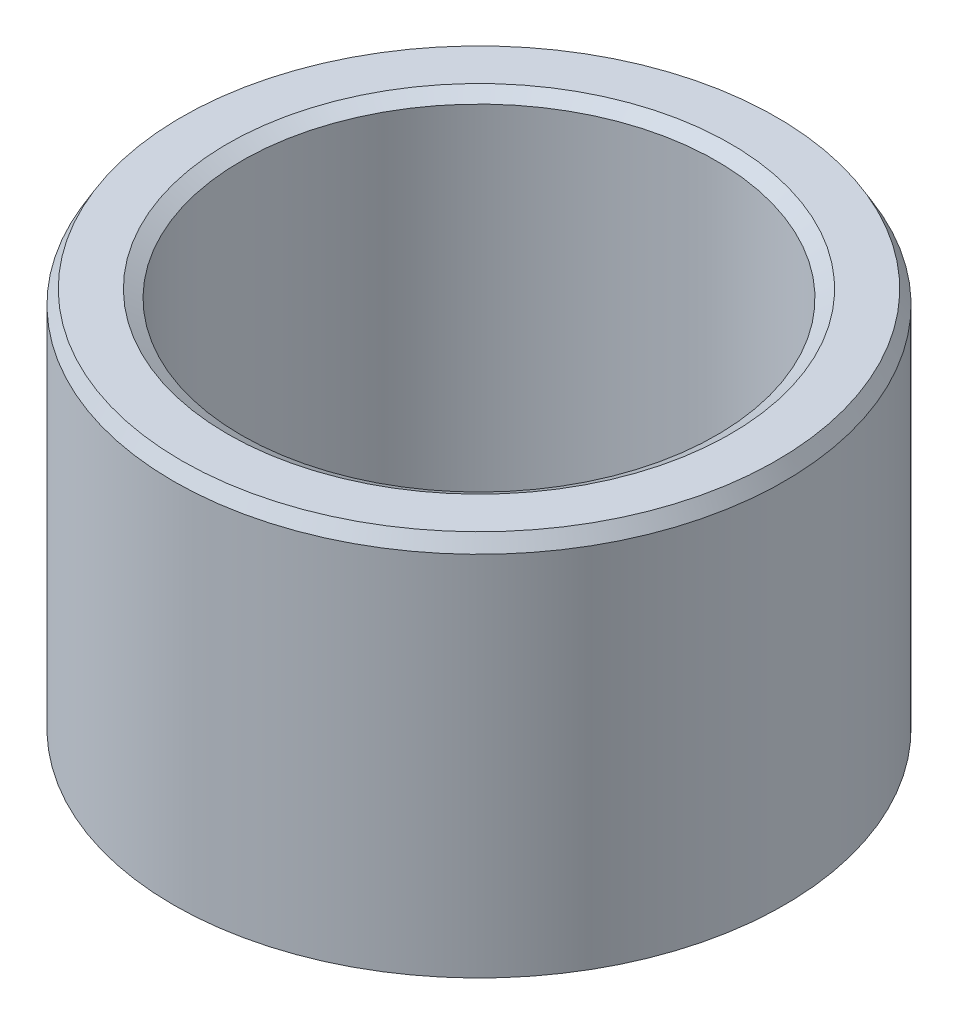
ISO-10303-21;
HEADER;
FILE_DESCRIPTION(('STEP AP214'),'2;1');
FILE_NAME('part.step','',(''),(''),'','','');
FILE_SCHEMA(('AUTOMOTIVE_DESIGN { 1 0 10303 214 1 1 1 1 }'));
ENDSEC;
DATA;
#1=APPLICATION_CONTEXT('core data for automotive mechanical design processes');
#2=APPLICATION_PROTOCOL_DEFINITION('international standard','automotive_design',2000,#1);
#3=PRODUCT_CONTEXT('',#1,'mechanical');
#4=PRODUCT('Part','Part','',(#3));
#5=PRODUCT_RELATED_PRODUCT_CATEGORY('part','',(#4));
#6=PRODUCT_DEFINITION_FORMATION('','',#4);
#7=PRODUCT_DEFINITION_CONTEXT('part definition',#1,'design');
#8=PRODUCT_DEFINITION('design','',#6,#7);
#9=PRODUCT_DEFINITION_SHAPE('','',#8);
#10=(LENGTH_UNIT() NAMED_UNIT(*) SI_UNIT(.MILLI.,.METRE.));
#11=(NAMED_UNIT(*) PLANE_ANGLE_UNIT() SI_UNIT($,.RADIAN.));
#12=(NAMED_UNIT(*) SI_UNIT($,.STERADIAN.) SOLID_ANGLE_UNIT());
#13=UNCERTAINTY_MEASURE_WITH_UNIT(LENGTH_MEASURE(1.E-05),#10,'distance_accuracy_value','');
#14=(GEOMETRIC_REPRESENTATION_CONTEXT(3) GLOBAL_UNCERTAINTY_ASSIGNED_CONTEXT((#13)) GLOBAL_UNIT_ASSIGNED_CONTEXT((#10,
#11,#12)) REPRESENTATION_CONTEXT('',''));
#15=CARTESIAN_POINT('',(0.,0.,0.));
#16=DIRECTION('',(0.,0.,1.));
#17=DIRECTION('',(1.,0.,0.));
#18=AXIS2_PLACEMENT_3D('',#15,#16,#17);
#19=CARTESIAN_POINT('',(0.,31.816042459885,0.));
#20=DIRECTION('',(0.,-1.,0.));
#21=DIRECTION('',(0.,0.,-1.));
#22=AXIS2_PLACEMENT_3D('',#19,#20,#21);
#23=CYLINDRICAL_SURFACE('',#22,25.);
#24=CARTESIAN_POINT('',(0.,0.65560041177011,0.));
#25=DIRECTION('',(0.,1.,0.));
#26=DIRECTION('',(0.,0.,1.));
#27=AXIS2_PLACEMENT_3D('',#24,#25,#26);
#28=CIRCLE('',#27,25.);
#29=CARTESIAN_POINT('',(0.,0.65560041177011,25.));
#30=VERTEX_POINT('',#29);
#31=EDGE_CURVE('E10',#30,#30,#28,.T.);
#32=ORIENTED_EDGE('',*,*,#31,.T.);
#33=EDGE_LOOP('',(#32));
#34=FACE_BOUND('',#33,.T.);
#35=CARTESIAN_POINT('',(0.,30.6805092372361,0.));
#36=DIRECTION('',(0.,1.,0.));
#37=DIRECTION('',(0.,0.,1.));
#38=AXIS2_PLACEMENT_3D('',#35,#36,#37);
#39=CIRCLE('',#38,25.);
#40=CARTESIAN_POINT('',(0.,30.6805092372361,25.));
#41=VERTEX_POINT('',#40);
#42=EDGE_CURVE('E50',#41,#41,#39,.F.);
#43=ORIENTED_EDGE('',*,*,#42,.T.);
#44=EDGE_LOOP('',(#43));
#45=FACE_BOUND('',#44,.T.);
#46=ADVANCED_FACE('F39',(#34,#45),#23,.T.);
#47=CARTESIAN_POINT('',(0.,31.816042459885,0.));
#48=DIRECTION('',(0.,1.,0.));
#49=DIRECTION('',(0.,0.,1.));
#50=AXIS2_PLACEMENT_3D('',#47,#48,#49);
#51=PLANE('',#50);
#52=CARTESIAN_POINT('',(0.,31.816042459885,0.));
#53=DIRECTION('',(0.,1.,0.));
#54=DIRECTION('',(0.,0.,1.));
#55=AXIS2_PLACEMENT_3D('',#52,#53,#54);
#56=CIRCLE('',#55,20.5763449435205);
#57=CARTESIAN_POINT('',(0.,31.816042459885,20.5763449435205));
#58=VERTEX_POINT('',#57);
#59=EDGE_CURVE('E58',#58,#58,#56,.F.);
#60=ORIENTED_EDGE('',*,*,#59,.T.);
#61=EDGE_LOOP('',(#60));
#62=FACE_BOUND('',#61,.T.);
#63=CARTESIAN_POINT('',(0.,31.816042459885,0.));
#64=DIRECTION('',(0.,1.,0.));
#65=DIRECTION('',(0.,0.,1.));
#66=AXIS2_PLACEMENT_3D('',#63,#64,#65);
#67=CIRCLE('',#66,24.3443995882299);
#68=CARTESIAN_POINT('',(0.,31.816042459885,24.3443995882299));
#69=VERTEX_POINT('',#68);
#70=EDGE_CURVE('E61',#69,#69,#67,.T.);
#71=ORIENTED_EDGE('',*,*,#70,.T.);
#72=EDGE_LOOP('',(#71));
#73=FACE_BOUND('',#72,.T.);
#74=ADVANCED_FACE('F88',(#62,#73),#51,.T.);
#75=CARTESIAN_POINT('',(0.,0.,0.));
#76=DIRECTION('',(0.,1.,0.));
#77=DIRECTION('',(0.,0.,1.));
#78=AXIS2_PLACEMENT_3D('',#75,#76,#77);
#79=PLANE('',#78);
#80=CARTESIAN_POINT('',(0.,0.,0.));
#81=DIRECTION('',(0.,1.,0.));
#82=DIRECTION('',(0.,0.,1.));
#83=AXIS2_PLACEMENT_3D('',#80,#81,#82);
#84=CIRCLE('',#83,20.0964121326417);
#85=CARTESIAN_POINT('',(0.,0.,20.0964121326417));
#86=VERTEX_POINT('',#85);
#87=EDGE_CURVE('E51',#86,#86,#84,.T.);
#88=ORIENTED_EDGE('',*,*,#87,.T.);
#89=EDGE_LOOP('',(#88));
#90=FACE_BOUND('',#89,.T.);
#91=CARTESIAN_POINT('',(0.,0.,0.));
#92=DIRECTION('',(0.,1.,0.));
#93=DIRECTION('',(0.,0.,1.));
#94=AXIS2_PLACEMENT_3D('',#91,#92,#93);
#95=CIRCLE('',#94,23.8644667773511);
#96=CARTESIAN_POINT('',(0.,0.,23.8644667773511));
#97=VERTEX_POINT('',#96);
#98=EDGE_CURVE('E54',#97,#97,#95,.F.);
#99=ORIENTED_EDGE('',*,*,#98,.T.);
#100=EDGE_LOOP('',(#99));
#101=FACE_BOUND('',#100,.T.);
#102=ADVANCED_FACE('F83',(#90,#101),#79,.F.);
#103=CARTESIAN_POINT('',(0.,31.816042459885,0.));
#104=DIRECTION('',(0.,-1.,0.));
#105=DIRECTION('',(0.,0.,-1.));
#106=AXIS2_PLACEMENT_3D('',#103,#104,#105);
#107=CYLINDRICAL_SURFACE('',#106,19.4408117208716);
#108=CARTESIAN_POINT('',(0.,31.1604420481149,0.));
#109=DIRECTION('',(0.,1.,0.));
#110=DIRECTION('',(0.,0.,1.));
#111=AXIS2_PLACEMENT_3D('',#108,#109,#110);
#112=CIRCLE('',#111,19.4408117208716);
#113=CARTESIAN_POINT('',(0.,31.1604420481149,19.4408117208716));
#114=VERTEX_POINT('',#113);
#115=EDGE_CURVE('E67',#114,#114,#112,.T.);
#116=ORIENTED_EDGE('',*,*,#115,.T.);
#117=EDGE_LOOP('',(#116));
#118=FACE_BOUND('',#117,.T.);
#119=CARTESIAN_POINT('',(0.,1.13553322264889,0.));
#120=DIRECTION('',(0.,1.,0.));
#121=DIRECTION('',(0.,0.,1.));
#122=AXIS2_PLACEMENT_3D('',#119,#120,#121);
#123=CIRCLE('',#122,19.4408117208716);
#124=CARTESIAN_POINT('',(0.,1.13553322264889,19.4408117208716));
#125=VERTEX_POINT('',#124);
#126=EDGE_CURVE('E69',#125,#125,#123,.F.);
#127=ORIENTED_EDGE('',*,*,#126,.T.);
#128=EDGE_LOOP('',(#127));
#129=FACE_BOUND('',#128,.T.);
#130=ADVANCED_FACE('F71',(#118,#129),#107,.F.);
#131=CARTESIAN_POINT('',(0.,31.1604420481149,0.));
#132=DIRECTION('',(0.,1.,0.));
#133=DIRECTION('',(0.,0.,1.));
#134=AXIS2_PLACEMENT_3D('',#131,#132,#133);
#135=CONICAL_SURFACE('',#134,19.4408117208716,1.0471975511966);
#136=ORIENTED_EDGE('',*,*,#59,.F.);
#137=EDGE_LOOP('',(#136));
#138=FACE_BOUND('',#137,.T.);
#139=ORIENTED_EDGE('',*,*,#115,.F.);
#140=EDGE_LOOP('',(#139));
#141=FACE_BOUND('',#140,.T.);
#142=ADVANCED_FACE('F77',(#138,#141),#135,.F.);
#143=CARTESIAN_POINT('',(0.,0.,0.));
#144=DIRECTION('',(0.,-1.,0.));
#145=DIRECTION('',(0.,0.,-1.));
#146=AXIS2_PLACEMENT_3D('',#143,#144,#145);
#147=CONICAL_SURFACE('',#146,20.0964121326417,0.523598775598291);
#148=ORIENTED_EDGE('',*,*,#126,.F.);
#149=EDGE_LOOP('',(#148));
#150=FACE_BOUND('',#149,.T.);
#151=ORIENTED_EDGE('',*,*,#87,.F.);
#152=EDGE_LOOP('',(#151));
#153=FACE_BOUND('',#152,.T.);
#154=ADVANCED_FACE('F73',(#150,#153),#147,.F.);
#155=CARTESIAN_POINT('',(0.,0.65560041177011,0.));
#156=DIRECTION('',(0.,1.,0.));
#157=DIRECTION('',(0.,0.,1.));
#158=AXIS2_PLACEMENT_3D('',#155,#156,#157);
#159=CONICAL_SURFACE('',#158,25.,1.0471975511966);
#160=ORIENTED_EDGE('',*,*,#98,.F.);
#161=EDGE_LOOP('',(#160));
#162=FACE_BOUND('',#161,.T.);
#163=ORIENTED_EDGE('',*,*,#31,.F.);
#164=EDGE_LOOP('',(#163));
#165=FACE_BOUND('',#164,.T.);
#166=ADVANCED_FACE('F76',(#162,#165),#159,.T.);
#167=CARTESIAN_POINT('',(0.,31.816042459885,0.));
#168=DIRECTION('',(0.,-1.,0.));
#169=DIRECTION('',(0.,0.,-1.));
#170=AXIS2_PLACEMENT_3D('',#167,#168,#169);
#171=CONICAL_SURFACE('',#170,24.3443995882299,0.523598775598298);
#172=ORIENTED_EDGE('',*,*,#42,.F.);
#173=EDGE_LOOP('',(#172));
#174=FACE_BOUND('',#173,.T.);
#175=ORIENTED_EDGE('',*,*,#70,.F.);
#176=EDGE_LOOP('',(#175));
#177=FACE_BOUND('',#176,.T.);
#178=ADVANCED_FACE('F45',(#174,#177),#171,.T.);
#179=CLOSED_SHELL('',(#46,#74,#102,#130,#142,#154,#166,#178));
#180=MANIFOLD_SOLID_BREP('B2',#179);
#181=ADVANCED_BREP_SHAPE_REPRESENTATION('',(#18,#180),#14);
#182=SHAPE_DEFINITION_REPRESENTATION(#9,#181);
ENDSEC;
END-ISO-10303-21;
